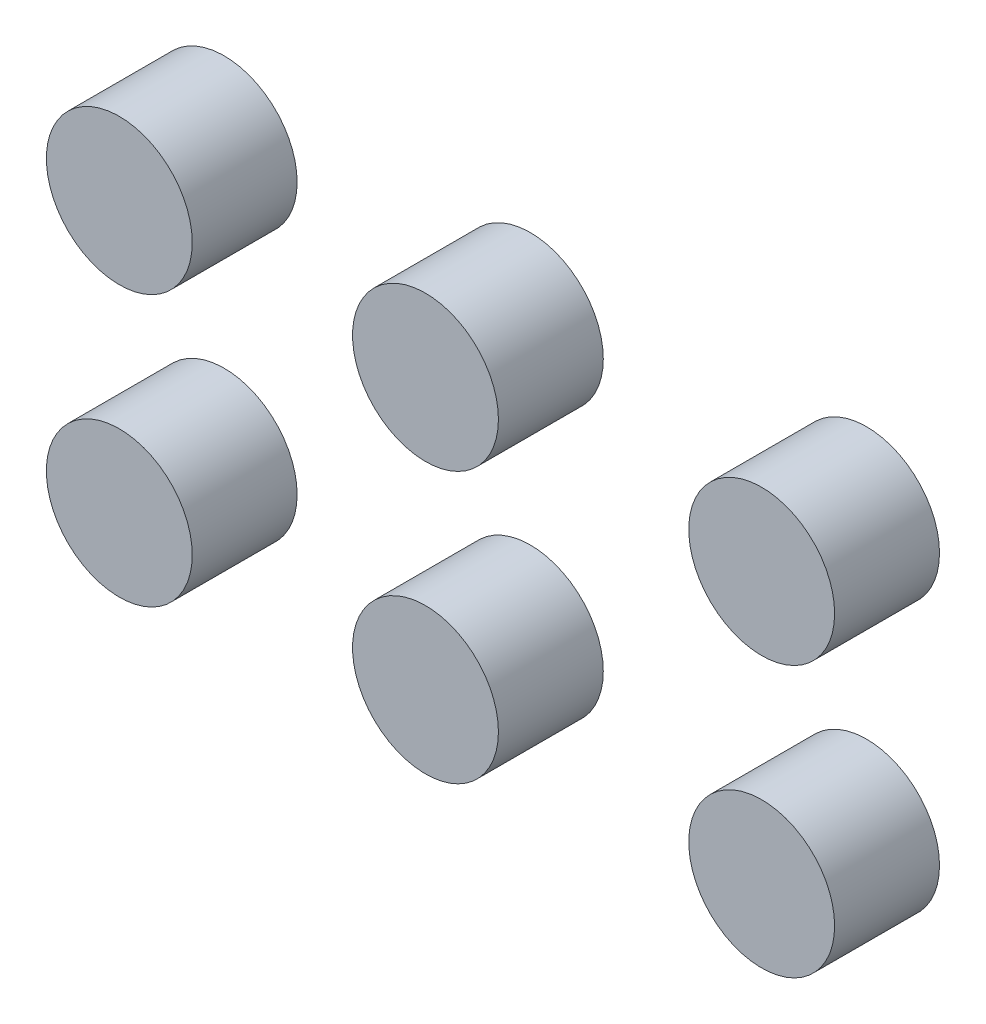
ISO-10303-21;
HEADER;
FILE_DESCRIPTION(('STEP AP214'),'2;1');
FILE_NAME('part.step','',(''),(''),'','','');
FILE_SCHEMA(('AUTOMOTIVE_DESIGN { 1 0 10303 214 1 1 1 1 }'));
ENDSEC;
DATA;
#1=APPLICATION_CONTEXT('core data for automotive mechanical design processes');
#2=APPLICATION_PROTOCOL_DEFINITION('international standard','automotive_design',2000,#1);
#3=PRODUCT_CONTEXT('',#1,'mechanical');
#4=PRODUCT('Part','Part','',(#3));
#5=PRODUCT_RELATED_PRODUCT_CATEGORY('part','',(#4));
#6=PRODUCT_DEFINITION_FORMATION('','',#4);
#7=PRODUCT_DEFINITION_CONTEXT('part definition',#1,'design');
#8=PRODUCT_DEFINITION('design','',#6,#7);
#9=PRODUCT_DEFINITION_SHAPE('','',#8);
#10=(LENGTH_UNIT() NAMED_UNIT(*) SI_UNIT(.MILLI.,.METRE.));
#11=(NAMED_UNIT(*) PLANE_ANGLE_UNIT() SI_UNIT($,.RADIAN.));
#12=(NAMED_UNIT(*) SI_UNIT($,.STERADIAN.) SOLID_ANGLE_UNIT());
#13=UNCERTAINTY_MEASURE_WITH_UNIT(LENGTH_MEASURE(1.E-05),#10,'distance_accuracy_value','');
#14=(GEOMETRIC_REPRESENTATION_CONTEXT(3) GLOBAL_UNCERTAINTY_ASSIGNED_CONTEXT((#13)) GLOBAL_UNIT_ASSIGNED_CONTEXT((#10,
#11,#12)) REPRESENTATION_CONTEXT('',''));
#15=CARTESIAN_POINT('',(0.,0.,0.));
#16=DIRECTION('',(0.,0.,1.));
#17=DIRECTION('',(1.,0.,0.));
#18=AXIS2_PLACEMENT_3D('',#15,#16,#17);
#19=CARTESIAN_POINT('',(108.225676225547,-62.8899557192175,40.));
#20=DIRECTION('',(0.,0.,-1.));
#21=DIRECTION('',(-1.,0.,0.));
#22=AXIS2_PLACEMENT_3D('',#19,#20,#21);
#23=CYLINDRICAL_SURFACE('',#22,27.8174748115369);
#24=CARTESIAN_POINT('',(108.225676225547,-62.8899557192175,40.));
#25=DIRECTION('',(0.,0.,1.));
#26=DIRECTION('',(1.,0.,0.));
#27=AXIS2_PLACEMENT_3D('',#24,#25,#26);
#28=CIRCLE('',#27,27.8174748115369);
#29=CARTESIAN_POINT('',(136.043151037084,-62.8899557192175,40.));
#30=VERTEX_POINT('',#29);
#31=EDGE_CURVE('E11',#30,#30,#28,.T.);
#32=ORIENTED_EDGE('',*,*,#31,.F.);
#33=EDGE_LOOP('',(#32));
#34=FACE_BOUND('',#33,.T.);
#35=CARTESIAN_POINT('',(108.225676225547,-62.8899557192175,0.));
#36=DIRECTION('',(0.,0.,1.));
#37=DIRECTION('',(1.,0.,0.));
#38=AXIS2_PLACEMENT_3D('',#35,#36,#37);
#39=CIRCLE('',#38,27.8174748115369);
#40=CARTESIAN_POINT('',(136.043151037084,-62.8899557192175,0.));
#41=VERTEX_POINT('',#40);
#42=EDGE_CURVE('E44',#41,#41,#39,.T.);
#43=ORIENTED_EDGE('',*,*,#42,.T.);
#44=EDGE_LOOP('',(#43));
#45=FACE_BOUND('',#44,.T.);
#46=ADVANCED_FACE('F41',(#34,#45),#23,.T.);
#47=CARTESIAN_POINT('',(108.225676225547,-62.8899557192175,40.));
#48=DIRECTION('',(0.,0.,1.));
#49=DIRECTION('',(1.,0.,0.));
#50=AXIS2_PLACEMENT_3D('',#47,#48,#49);
#51=PLANE('',#50);
#52=ORIENTED_EDGE('',*,*,#31,.T.);
#53=EDGE_LOOP('',(#52));
#54=FACE_BOUND('',#53,.T.);
#55=ADVANCED_FACE('F56',(#54),#51,.T.);
#56=CARTESIAN_POINT('',(108.225676225547,-62.8899557192175,0.));
#57=DIRECTION('',(0.,0.,1.));
#58=DIRECTION('',(1.,0.,0.));
#59=AXIS2_PLACEMENT_3D('',#56,#57,#58);
#60=PLANE('',#59);
#61=ORIENTED_EDGE('',*,*,#42,.F.);
#62=EDGE_LOOP('',(#61));
#63=FACE_BOUND('',#62,.T.);
#64=ADVANCED_FACE('F54',(#63),#60,.F.);
#65=CLOSED_SHELL('',(#46,#55,#64));
#66=MANIFOLD_SOLID_BREP('B2',#65);
#67=CARTESIAN_POINT('',(-19.9965635903337,-62.8899557192175,40.));
#68=DIRECTION('',(0.,0.,-1.));
#69=DIRECTION('',(-1.,0.,0.));
#70=AXIS2_PLACEMENT_3D('',#67,#68,#69);
#71=CYLINDRICAL_SURFACE('',#70,27.8174748115369);
#72=CARTESIAN_POINT('',(-19.9965635903337,-62.8899557192175,40.));
#73=DIRECTION('',(0.,0.,1.));
#74=DIRECTION('',(1.,0.,0.));
#75=AXIS2_PLACEMENT_3D('',#72,#73,#74);
#76=CIRCLE('',#75,27.8174748115369);
#77=CARTESIAN_POINT('',(7.82091122120318,-62.8899557192175,40.));
#78=VERTEX_POINT('',#77);
#79=EDGE_CURVE('E40',#78,#78,#76,.T.);
#80=ORIENTED_EDGE('',*,*,#79,.F.);
#81=EDGE_LOOP('',(#80));
#82=FACE_BOUND('',#81,.T.);
#83=CARTESIAN_POINT('',(-19.9965635903337,-62.8899557192175,0.));
#84=DIRECTION('',(0.,0.,1.));
#85=DIRECTION('',(1.,0.,0.));
#86=AXIS2_PLACEMENT_3D('',#83,#84,#85);
#87=CIRCLE('',#86,27.8174748115369);
#88=CARTESIAN_POINT('',(7.82091122120318,-62.8899557192175,0.));
#89=VERTEX_POINT('',#88);
#90=EDGE_CURVE('E92',#89,#89,#87,.T.);
#91=ORIENTED_EDGE('',*,*,#90,.T.);
#92=EDGE_LOOP('',(#91));
#93=FACE_BOUND('',#92,.T.);
#94=ADVANCED_FACE('F89',(#82,#93),#71,.T.);
#95=CARTESIAN_POINT('',(-19.9965635903337,-62.8899557192175,40.));
#96=DIRECTION('',(0.,0.,1.));
#97=DIRECTION('',(1.,0.,0.));
#98=AXIS2_PLACEMENT_3D('',#95,#96,#97);
#99=PLANE('',#98);
#100=ORIENTED_EDGE('',*,*,#79,.T.);
#101=EDGE_LOOP('',(#100));
#102=FACE_BOUND('',#101,.T.);
#103=ADVANCED_FACE('F104',(#102),#99,.T.);
#104=CARTESIAN_POINT('',(-19.9965635903337,-62.8899557192175,0.));
#105=DIRECTION('',(0.,0.,1.));
#106=DIRECTION('',(1.,0.,0.));
#107=AXIS2_PLACEMENT_3D('',#104,#105,#106);
#108=PLANE('',#107);
#109=ORIENTED_EDGE('',*,*,#90,.F.);
#110=EDGE_LOOP('',(#109));
#111=FACE_BOUND('',#110,.T.);
#112=ADVANCED_FACE('F102',(#111),#108,.F.);
#113=CLOSED_SHELL('',(#94,#103,#112));
#114=MANIFOLD_SOLID_BREP('B6',#113);
#115=CARTESIAN_POINT('',(-136.770389136939,-62.8899557192175,40.));
#116=DIRECTION('',(0.,0.,-1.));
#117=DIRECTION('',(-1.,0.,0.));
#118=AXIS2_PLACEMENT_3D('',#115,#116,#117);
#119=CYLINDRICAL_SURFACE('',#118,27.8174748115369);
#120=CARTESIAN_POINT('',(-136.770389136939,-62.8899557192175,40.));
#121=DIRECTION('',(0.,0.,1.));
#122=DIRECTION('',(1.,0.,0.));
#123=AXIS2_PLACEMENT_3D('',#120,#121,#122);
#124=CIRCLE('',#123,27.8174748115369);
#125=CARTESIAN_POINT('',(-108.952914325402,-62.8899557192175,40.));
#126=VERTEX_POINT('',#125);
#127=EDGE_CURVE('E88',#126,#126,#124,.T.);
#128=ORIENTED_EDGE('',*,*,#127,.F.);
#129=EDGE_LOOP('',(#128));
#130=FACE_BOUND('',#129,.T.);
#131=CARTESIAN_POINT('',(-136.770389136939,-62.8899557192175,0.));
#132=DIRECTION('',(0.,0.,1.));
#133=DIRECTION('',(1.,0.,0.));
#134=AXIS2_PLACEMENT_3D('',#131,#132,#133);
#135=CIRCLE('',#134,27.8174748115369);
#136=CARTESIAN_POINT('',(-108.952914325402,-62.8899557192175,0.));
#137=VERTEX_POINT('',#136);
#138=EDGE_CURVE('E140',#137,#137,#135,.T.);
#139=ORIENTED_EDGE('',*,*,#138,.T.);
#140=EDGE_LOOP('',(#139));
#141=FACE_BOUND('',#140,.T.);
#142=ADVANCED_FACE('F137',(#130,#141),#119,.T.);
#143=CARTESIAN_POINT('',(-136.770389136939,-62.8899557192175,40.));
#144=DIRECTION('',(0.,0.,1.));
#145=DIRECTION('',(1.,0.,0.));
#146=AXIS2_PLACEMENT_3D('',#143,#144,#145);
#147=PLANE('',#146);
#148=ORIENTED_EDGE('',*,*,#127,.T.);
#149=EDGE_LOOP('',(#148));
#150=FACE_BOUND('',#149,.T.);
#151=ADVANCED_FACE('F152',(#150),#147,.T.);
#152=CARTESIAN_POINT('',(-136.770389136939,-62.8899557192175,0.));
#153=DIRECTION('',(0.,0.,1.));
#154=DIRECTION('',(1.,0.,0.));
#155=AXIS2_PLACEMENT_3D('',#152,#153,#154);
#156=PLANE('',#155);
#157=ORIENTED_EDGE('',*,*,#138,.F.);
#158=EDGE_LOOP('',(#157));
#159=FACE_BOUND('',#158,.T.);
#160=ADVANCED_FACE('F150',(#159),#156,.F.);
#161=CLOSED_SHELL('',(#142,#151,#160));
#162=MANIFOLD_SOLID_BREP('B35',#161);
#163=CARTESIAN_POINT('',(108.225676225547,40.2984182278481,40.));
#164=DIRECTION('',(0.,0.,-1.));
#165=DIRECTION('',(-1.,0.,0.));
#166=AXIS2_PLACEMENT_3D('',#163,#164,#165);
#167=CYLINDRICAL_SURFACE('',#166,27.8174748115369);
#168=CARTESIAN_POINT('',(108.225676225547,40.2984182278481,40.));
#169=DIRECTION('',(0.,0.,1.));
#170=DIRECTION('',(1.,0.,0.));
#171=AXIS2_PLACEMENT_3D('',#168,#169,#170);
#172=CIRCLE('',#171,27.8174748115369);
#173=CARTESIAN_POINT('',(136.043151037084,40.2984182278481,40.));
#174=VERTEX_POINT('',#173);
#175=EDGE_CURVE('E136',#174,#174,#172,.T.);
#176=ORIENTED_EDGE('',*,*,#175,.F.);
#177=EDGE_LOOP('',(#176));
#178=FACE_BOUND('',#177,.T.);
#179=CARTESIAN_POINT('',(108.225676225547,40.2984182278481,0.));
#180=DIRECTION('',(0.,0.,1.));
#181=DIRECTION('',(1.,0.,0.));
#182=AXIS2_PLACEMENT_3D('',#179,#180,#181);
#183=CIRCLE('',#182,27.8174748115369);
#184=CARTESIAN_POINT('',(136.043151037084,40.2984182278481,0.));
#185=VERTEX_POINT('',#184);
#186=EDGE_CURVE('E188',#185,#185,#183,.T.);
#187=ORIENTED_EDGE('',*,*,#186,.T.);
#188=EDGE_LOOP('',(#187));
#189=FACE_BOUND('',#188,.T.);
#190=ADVANCED_FACE('F185',(#178,#189),#167,.T.);
#191=CARTESIAN_POINT('',(108.225676225547,40.2984182278481,40.));
#192=DIRECTION('',(0.,0.,1.));
#193=DIRECTION('',(1.,0.,0.));
#194=AXIS2_PLACEMENT_3D('',#191,#192,#193);
#195=PLANE('',#194);
#196=ORIENTED_EDGE('',*,*,#175,.T.);
#197=EDGE_LOOP('',(#196));
#198=FACE_BOUND('',#197,.T.);
#199=ADVANCED_FACE('F200',(#198),#195,.T.);
#200=CARTESIAN_POINT('',(108.225676225547,40.2984182278481,0.));
#201=DIRECTION('',(0.,0.,1.));
#202=DIRECTION('',(1.,0.,0.));
#203=AXIS2_PLACEMENT_3D('',#200,#201,#202);
#204=PLANE('',#203);
#205=ORIENTED_EDGE('',*,*,#186,.F.);
#206=EDGE_LOOP('',(#205));
#207=FACE_BOUND('',#206,.T.);
#208=ADVANCED_FACE('F198',(#207),#204,.F.);
#209=CLOSED_SHELL('',(#190,#199,#208));
#210=MANIFOLD_SOLID_BREP('B83',#209);
#211=CARTESIAN_POINT('',(-19.9965635903337,40.2984182278481,40.));
#212=DIRECTION('',(0.,0.,-1.));
#213=DIRECTION('',(-1.,0.,0.));
#214=AXIS2_PLACEMENT_3D('',#211,#212,#213);
#215=CYLINDRICAL_SURFACE('',#214,27.8174748115369);
#216=CARTESIAN_POINT('',(-19.9965635903337,40.2984182278481,40.));
#217=DIRECTION('',(0.,0.,1.));
#218=DIRECTION('',(1.,0.,0.));
#219=AXIS2_PLACEMENT_3D('',#216,#217,#218);
#220=CIRCLE('',#219,27.8174748115369);
#221=CARTESIAN_POINT('',(7.82091122120318,40.2984182278481,40.));
#222=VERTEX_POINT('',#221);
#223=EDGE_CURVE('E184',#222,#222,#220,.T.);
#224=ORIENTED_EDGE('',*,*,#223,.F.);
#225=EDGE_LOOP('',(#224));
#226=FACE_BOUND('',#225,.T.);
#227=CARTESIAN_POINT('',(-19.9965635903337,40.2984182278481,0.));
#228=DIRECTION('',(0.,0.,1.));
#229=DIRECTION('',(1.,0.,0.));
#230=AXIS2_PLACEMENT_3D('',#227,#228,#229);
#231=CIRCLE('',#230,27.8174748115369);
#232=CARTESIAN_POINT('',(7.82091122120318,40.2984182278481,0.));
#233=VERTEX_POINT('',#232);
#234=EDGE_CURVE('E235',#233,#233,#231,.T.);
#235=ORIENTED_EDGE('',*,*,#234,.T.);
#236=EDGE_LOOP('',(#235));
#237=FACE_BOUND('',#236,.T.);
#238=ADVANCED_FACE('F232',(#226,#237),#215,.T.);
#239=CARTESIAN_POINT('',(-19.9965635903337,40.2984182278481,40.));
#240=DIRECTION('',(0.,0.,1.));
#241=DIRECTION('',(1.,0.,0.));
#242=AXIS2_PLACEMENT_3D('',#239,#240,#241);
#243=PLANE('',#242);
#244=ORIENTED_EDGE('',*,*,#223,.T.);
#245=EDGE_LOOP('',(#244));
#246=FACE_BOUND('',#245,.T.);
#247=ADVANCED_FACE('F247',(#246),#243,.T.);
#248=CARTESIAN_POINT('',(-19.9965635903337,40.2984182278481,0.));
#249=DIRECTION('',(0.,0.,1.));
#250=DIRECTION('',(1.,0.,0.));
#251=AXIS2_PLACEMENT_3D('',#248,#249,#250);
#252=PLANE('',#251);
#253=ORIENTED_EDGE('',*,*,#234,.F.);
#254=EDGE_LOOP('',(#253));
#255=FACE_BOUND('',#254,.T.);
#256=ADVANCED_FACE('F245',(#255),#252,.F.);
#257=CLOSED_SHELL('',(#238,#247,#256));
#258=MANIFOLD_SOLID_BREP('B131',#257);
#259=CARTESIAN_POINT('',(-136.770389136939,40.2984182278481,40.));
#260=DIRECTION('',(0.,0.,-1.));
#261=DIRECTION('',(-1.,0.,0.));
#262=AXIS2_PLACEMENT_3D('',#259,#260,#261);
#263=CYLINDRICAL_SURFACE('',#262,27.8174748115369);
#264=CARTESIAN_POINT('',(-136.770389136939,40.2984182278481,40.));
#265=DIRECTION('',(0.,0.,1.));
#266=DIRECTION('',(1.,0.,0.));
#267=AXIS2_PLACEMENT_3D('',#264,#265,#266);
#268=CIRCLE('',#267,27.8174748115369);
#269=CARTESIAN_POINT('',(-108.952914325402,40.2984182278481,40.));
#270=VERTEX_POINT('',#269);
#271=EDGE_CURVE('E231',#270,#270,#268,.T.);
#272=ORIENTED_EDGE('',*,*,#271,.F.);
#273=EDGE_LOOP('',(#272));
#274=FACE_BOUND('',#273,.T.);
#275=CARTESIAN_POINT('',(-136.770389136939,40.2984182278481,0.));
#276=DIRECTION('',(0.,0.,1.));
#277=DIRECTION('',(1.,0.,0.));
#278=AXIS2_PLACEMENT_3D('',#275,#276,#277);
#279=CIRCLE('',#278,27.8174748115369);
#280=CARTESIAN_POINT('',(-108.952914325402,40.2984182278481,0.));
#281=VERTEX_POINT('',#280);
#282=EDGE_CURVE('E275',#281,#281,#279,.T.);
#283=ORIENTED_EDGE('',*,*,#282,.T.);
#284=EDGE_LOOP('',(#283));
#285=FACE_BOUND('',#284,.T.);
#286=ADVANCED_FACE('F272',(#274,#285),#263,.T.);
#287=CARTESIAN_POINT('',(-136.770389136939,40.2984182278481,40.));
#288=DIRECTION('',(0.,0.,1.));
#289=DIRECTION('',(1.,0.,0.));
#290=AXIS2_PLACEMENT_3D('',#287,#288,#289);
#291=PLANE('',#290);
#292=ORIENTED_EDGE('',*,*,#271,.T.);
#293=EDGE_LOOP('',(#292));
#294=FACE_BOUND('',#293,.T.);
#295=ADVANCED_FACE('F287',(#294),#291,.T.);
#296=CARTESIAN_POINT('',(-136.770389136939,40.2984182278481,0.));
#297=DIRECTION('',(0.,0.,1.));
#298=DIRECTION('',(1.,0.,0.));
#299=AXIS2_PLACEMENT_3D('',#296,#297,#298);
#300=PLANE('',#299);
#301=ORIENTED_EDGE('',*,*,#282,.F.);
#302=EDGE_LOOP('',(#301));
#303=FACE_BOUND('',#302,.T.);
#304=ADVANCED_FACE('F285',(#303),#300,.F.);
#305=CLOSED_SHELL('',(#286,#295,#304));
#306=MANIFOLD_SOLID_BREP('B179',#305);
#307=ADVANCED_BREP_SHAPE_REPRESENTATION('',(#18,#66,#114,#162,#210,#258,#306),#14);
#308=SHAPE_DEFINITION_REPRESENTATION(#9,#307);
ENDSEC;
END-ISO-10303-21;
